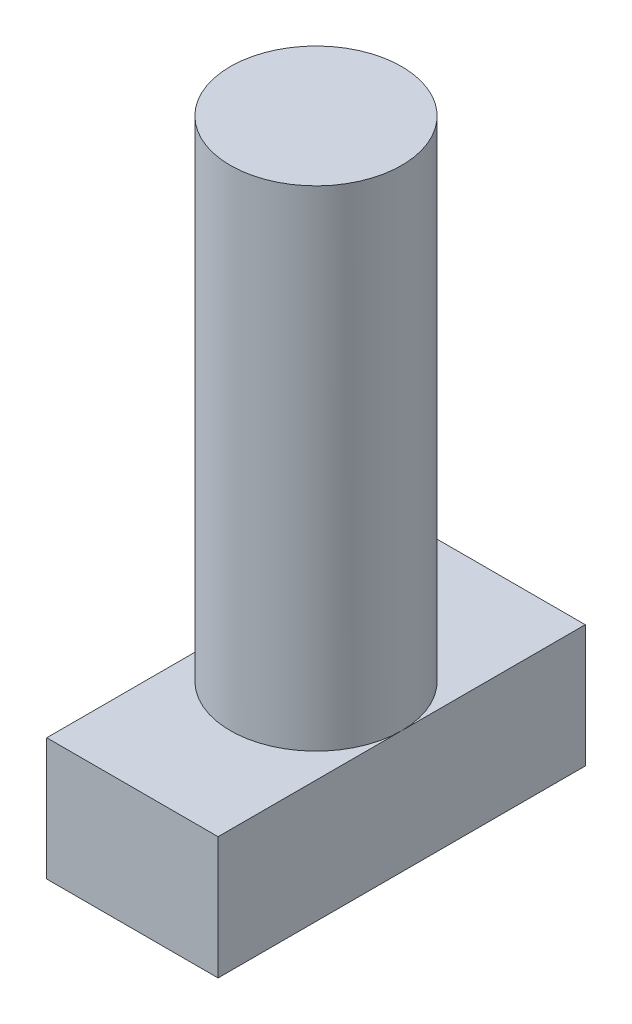
ISO-10303-21;
HEADER;
FILE_DESCRIPTION(('STEP AP214'),'2;1');
FILE_NAME('part.step','',(''),(''),'','','');
FILE_SCHEMA(('AUTOMOTIVE_DESIGN { 1 0 10303 214 1 1 1 1 }'));
ENDSEC;
DATA;
#1=APPLICATION_CONTEXT('core data for automotive mechanical design processes');
#2=APPLICATION_PROTOCOL_DEFINITION('international standard','automotive_design',2000,#1);
#3=PRODUCT_CONTEXT('',#1,'mechanical');
#4=PRODUCT('Part','Part','',(#3));
#5=PRODUCT_RELATED_PRODUCT_CATEGORY('part','',(#4));
#6=PRODUCT_DEFINITION_FORMATION('','',#4);
#7=PRODUCT_DEFINITION_CONTEXT('part definition',#1,'design');
#8=PRODUCT_DEFINITION('design','',#6,#7);
#9=PRODUCT_DEFINITION_SHAPE('','',#8);
#10=(LENGTH_UNIT() NAMED_UNIT(*) SI_UNIT(.MILLI.,.METRE.));
#11=(NAMED_UNIT(*) PLANE_ANGLE_UNIT() SI_UNIT($,.RADIAN.));
#12=(NAMED_UNIT(*) SI_UNIT($,.STERADIAN.) SOLID_ANGLE_UNIT());
#13=UNCERTAINTY_MEASURE_WITH_UNIT(LENGTH_MEASURE(1.E-05),#10,'distance_accuracy_value','');
#14=(GEOMETRIC_REPRESENTATION_CONTEXT(3) GLOBAL_UNCERTAINTY_ASSIGNED_CONTEXT((#13)) GLOBAL_UNIT_ASSIGNED_CONTEXT((#10,
#11,#12)) REPRESENTATION_CONTEXT('',''));
#15=CARTESIAN_POINT('',(0.,0.,0.));
#16=DIRECTION('',(0.,0.,1.));
#17=DIRECTION('',(1.,0.,0.));
#18=AXIS2_PLACEMENT_3D('',#15,#16,#17);
#19=CARTESIAN_POINT('',(0.,10.,0.));
#20=DIRECTION('',(0.,-1.,0.));
#21=DIRECTION('',(0.,0.,-1.));
#22=AXIS2_PLACEMENT_3D('',#19,#20,#21);
#23=PLANE('',#22);
#24=CARTESIAN_POINT('',(0.,10.,0.));
#25=DIRECTION('',(0.,1.,0.));
#26=DIRECTION('',(0.,0.,1.));
#27=AXIS2_PLACEMENT_3D('',#24,#25,#26);
#28=CIRCLE('',#27,7.);
#29=CARTESIAN_POINT('',(7.,10.,0.));
#30=VERTEX_POINT('',#29);
#31=CARTESIAN_POINT('',(-7.,10.,0.));
#32=VERTEX_POINT('',#31);
#33=EDGE_CURVE('E51',#30,#32,#28,.T.);
#34=ORIENTED_EDGE('',*,*,#33,.F.);
#35=DIRECTION('',(0.,0.,-1.));
#36=VECTOR('',#35,1.);
#37=CARTESIAN_POINT('',(7.,10.,-15.));
#38=LINE('',#37,#36);
#39=CARTESIAN_POINT('',(7.,10.,-15.));
#40=VERTEX_POINT('',#39);
#41=EDGE_CURVE('E101',#30,#40,#38,.T.);
#42=ORIENTED_EDGE('',*,*,#41,.T.);
#43=DIRECTION('',(-1.,0.,0.));
#44=VECTOR('',#43,1.);
#45=CARTESIAN_POINT('',(7.,10.,-15.));
#46=LINE('',#45,#44);
#47=CARTESIAN_POINT('',(-7.,10.,-15.));
#48=VERTEX_POINT('',#47);
#49=EDGE_CURVE('E65',#40,#48,#46,.T.);
#50=ORIENTED_EDGE('',*,*,#49,.T.);
#51=DIRECTION('',(0.,0.,1.));
#52=VECTOR('',#51,1.);
#53=CARTESIAN_POINT('',(-7.,10.,-15.));
#54=LINE('',#53,#52);
#55=EDGE_CURVE('E109',#48,#32,#54,.T.);
#56=ORIENTED_EDGE('',*,*,#55,.T.);
#57=EDGE_LOOP('',(#34,#42,#50,#56));
#58=FACE_BOUND('',#57,.T.);
#59=ADVANCED_FACE('F41',(#58),#23,.F.);
#60=CARTESIAN_POINT('',(-7.,10.,-15.));
#61=DIRECTION('',(1.,0.,0.));
#62=DIRECTION('',(0.,0.,-1.));
#63=AXIS2_PLACEMENT_3D('',#60,#61,#62);
#64=PLANE('',#63);
#65=DIRECTION('',(0.,0.,1.));
#66=VECTOR('',#65,1.);
#67=CARTESIAN_POINT('',(-7.,0.,-15.));
#68=LINE('',#67,#66);
#69=CARTESIAN_POINT('',(-7.,0.,-15.));
#70=VERTEX_POINT('',#69);
#71=CARTESIAN_POINT('',(-7.,0.,15.));
#72=VERTEX_POINT('',#71);
#73=EDGE_CURVE('E156',#70,#72,#68,.T.);
#74=ORIENTED_EDGE('',*,*,#73,.T.);
#75=DIRECTION('',(0.,-1.,0.));
#76=VECTOR('',#75,1.);
#77=CARTESIAN_POINT('',(-7.,10.,15.));
#78=LINE('',#77,#76);
#79=CARTESIAN_POINT('',(-7.,10.,15.));
#80=VERTEX_POINT('',#79);
#81=EDGE_CURVE('E45',#80,#72,#78,.T.);
#82=ORIENTED_EDGE('',*,*,#81,.F.);
#83=EDGE_CURVE('E90',#32,#80,#54,.T.);
#84=ORIENTED_EDGE('',*,*,#83,.F.);
#85=ORIENTED_EDGE('',*,*,#55,.F.);
#86=DIRECTION('',(0.,-1.,0.));
#87=VECTOR('',#86,1.);
#88=CARTESIAN_POINT('',(-7.,10.,-15.));
#89=LINE('',#88,#87);
#90=EDGE_CURVE('E162',#48,#70,#89,.T.);
#91=ORIENTED_EDGE('',*,*,#90,.T.);
#92=EDGE_LOOP('',(#74,#82,#84,#85,#91));
#93=FACE_BOUND('',#92,.T.);
#94=ADVANCED_FACE('F43',(#93),#64,.F.);
#95=CARTESIAN_POINT('',(7.,10.,15.));
#96=DIRECTION('',(0.,0.,-1.));
#97=DIRECTION('',(-1.,0.,0.));
#98=AXIS2_PLACEMENT_3D('',#95,#96,#97);
#99=PLANE('',#98);
#100=DIRECTION('',(1.,0.,0.));
#101=VECTOR('',#100,1.);
#102=CARTESIAN_POINT('',(7.,0.,15.));
#103=LINE('',#102,#101);
#104=CARTESIAN_POINT('',(7.,0.,15.));
#105=VERTEX_POINT('',#104);
#106=EDGE_CURVE('E149',#72,#105,#103,.T.);
#107=ORIENTED_EDGE('',*,*,#106,.T.);
#108=DIRECTION('',(0.,-1.,0.));
#109=VECTOR('',#108,1.);
#110=CARTESIAN_POINT('',(7.,10.,15.));
#111=LINE('',#110,#109);
#112=CARTESIAN_POINT('',(7.,10.,15.));
#113=VERTEX_POINT('',#112);
#114=EDGE_CURVE('E150',#113,#105,#111,.T.);
#115=ORIENTED_EDGE('',*,*,#114,.F.);
#116=DIRECTION('',(1.,0.,0.));
#117=VECTOR('',#116,1.);
#118=CARTESIAN_POINT('',(7.,10.,15.));
#119=LINE('',#118,#117);
#120=EDGE_CURVE('E97',#80,#113,#119,.T.);
#121=ORIENTED_EDGE('',*,*,#120,.F.);
#122=ORIENTED_EDGE('',*,*,#81,.T.);
#123=EDGE_LOOP('',(#107,#115,#121,#122));
#124=FACE_BOUND('',#123,.T.);
#125=ADVANCED_FACE('F132',(#124),#99,.F.);
#126=CARTESIAN_POINT('',(7.,10.,-15.));
#127=DIRECTION('',(-1.,0.,0.));
#128=DIRECTION('',(0.,0.,1.));
#129=AXIS2_PLACEMENT_3D('',#126,#127,#128);
#130=PLANE('',#129);
#131=DIRECTION('',(0.,0.,-1.));
#132=VECTOR('',#131,1.);
#133=CARTESIAN_POINT('',(7.,0.,-15.));
#134=LINE('',#133,#132);
#135=CARTESIAN_POINT('',(7.,0.,-15.));
#136=VERTEX_POINT('',#135);
#137=EDGE_CURVE('E155',#105,#136,#134,.T.);
#138=ORIENTED_EDGE('',*,*,#137,.T.);
#139=DIRECTION('',(0.,-1.,0.));
#140=VECTOR('',#139,1.);
#141=CARTESIAN_POINT('',(7.,10.,-15.));
#142=LINE('',#141,#140);
#143=EDGE_CURVE('E106',#40,#136,#142,.T.);
#144=ORIENTED_EDGE('',*,*,#143,.F.);
#145=ORIENTED_EDGE('',*,*,#41,.F.);
#146=EDGE_CURVE('E94',#113,#30,#38,.T.);
#147=ORIENTED_EDGE('',*,*,#146,.F.);
#148=ORIENTED_EDGE('',*,*,#114,.T.);
#149=EDGE_LOOP('',(#138,#144,#145,#147,#148));
#150=FACE_BOUND('',#149,.T.);
#151=ADVANCED_FACE('F105',(#150),#130,.F.);
#152=CARTESIAN_POINT('',(7.,10.,-15.));
#153=DIRECTION('',(0.,0.,1.));
#154=DIRECTION('',(1.,0.,0.));
#155=AXIS2_PLACEMENT_3D('',#152,#153,#154);
#156=PLANE('',#155);
#157=DIRECTION('',(-1.,0.,0.));
#158=VECTOR('',#157,1.);
#159=CARTESIAN_POINT('',(7.,0.,-15.));
#160=LINE('',#159,#158);
#161=EDGE_CURVE('E86',#136,#70,#160,.T.);
#162=ORIENTED_EDGE('',*,*,#161,.T.);
#163=ORIENTED_EDGE('',*,*,#90,.F.);
#164=ORIENTED_EDGE('',*,*,#49,.F.);
#165=ORIENTED_EDGE('',*,*,#143,.T.);
#166=EDGE_LOOP('',(#162,#163,#164,#165));
#167=FACE_BOUND('',#166,.T.);
#168=ADVANCED_FACE('F135',(#167),#156,.F.);
#169=EDGE_CURVE('E11',#32,#30,#28,.T.);
#170=ORIENTED_EDGE('',*,*,#169,.F.);
#171=ORIENTED_EDGE('',*,*,#83,.T.);
#172=ORIENTED_EDGE('',*,*,#120,.T.);
#173=ORIENTED_EDGE('',*,*,#146,.T.);
#174=EDGE_LOOP('',(#170,#171,#172,#173));
#175=FACE_BOUND('',#174,.T.);
#176=ADVANCED_FACE('F96',(#175),#23,.F.);
#177=CARTESIAN_POINT('',(0.,0.,0.));
#178=DIRECTION('',(0.,-1.,0.));
#179=DIRECTION('',(0.,0.,-1.));
#180=AXIS2_PLACEMENT_3D('',#177,#178,#179);
#181=PLANE('',#180);
#182=ORIENTED_EDGE('',*,*,#73,.F.);
#183=ORIENTED_EDGE('',*,*,#161,.F.);
#184=ORIENTED_EDGE('',*,*,#137,.F.);
#185=ORIENTED_EDGE('',*,*,#106,.F.);
#186=EDGE_LOOP('',(#182,#183,#184,#185));
#187=FACE_BOUND('',#186,.T.);
#188=ADVANCED_FACE('F115',(#187),#181,.T.);
#189=CARTESIAN_POINT('',(0.,50.,0.));
#190=DIRECTION('',(0.,-1.,0.));
#191=DIRECTION('',(0.,0.,-1.));
#192=AXIS2_PLACEMENT_3D('',#189,#190,#191);
#193=CYLINDRICAL_SURFACE('',#192,7.);
#194=CARTESIAN_POINT('',(0.,50.,0.));
#195=DIRECTION('',(0.,1.,0.));
#196=DIRECTION('',(0.,0.,1.));
#197=AXIS2_PLACEMENT_3D('',#194,#195,#196);
#198=CIRCLE('',#197,7.);
#199=CARTESIAN_POINT('',(0.,50.,7.));
#200=VERTEX_POINT('',#199);
#201=EDGE_CURVE('E111',#200,#200,#198,.T.);
#202=ORIENTED_EDGE('',*,*,#201,.F.);
#203=EDGE_LOOP('',(#202));
#204=FACE_BOUND('',#203,.T.);
#205=ORIENTED_EDGE('',*,*,#33,.T.);
#206=ORIENTED_EDGE('',*,*,#169,.T.);
#207=EDGE_LOOP('',(#205,#206));
#208=FACE_BOUND('',#207,.T.);
#209=ADVANCED_FACE('F112',(#204,#208),#193,.T.);
#210=CARTESIAN_POINT('',(0.,50.,0.));
#211=DIRECTION('',(0.,1.,0.));
#212=DIRECTION('',(0.,0.,1.));
#213=AXIS2_PLACEMENT_3D('',#210,#211,#212);
#214=PLANE('',#213);
#215=ORIENTED_EDGE('',*,*,#201,.T.);
#216=EDGE_LOOP('',(#215));
#217=FACE_BOUND('',#216,.T.);
#218=ADVANCED_FACE('F114',(#217),#214,.T.);
#219=CLOSED_SHELL('',(#59,#94,#125,#151,#168,#176,#188,#209,#218));
#220=MANIFOLD_SOLID_BREP('B2',#219);
#221=ADVANCED_BREP_SHAPE_REPRESENTATION('',(#18,#220),#14);
#222=SHAPE_DEFINITION_REPRESENTATION(#9,#221);
ENDSEC;
END-ISO-10303-21;
